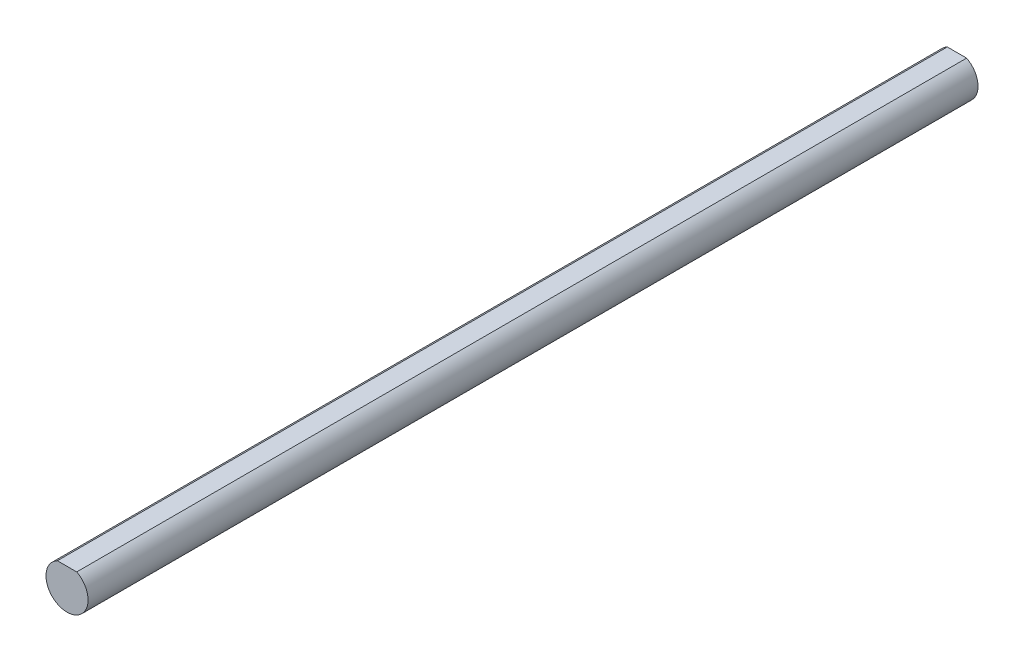
ISO-10303-21;
HEADER;
FILE_DESCRIPTION(('STEP AP214'),'2;1');
FILE_NAME('part.step','',(''),(''),'','','');
FILE_SCHEMA(('AUTOMOTIVE_DESIGN { 1 0 10303 214 1 1 1 1 }'));
ENDSEC;
DATA;
#1=APPLICATION_CONTEXT('core data for automotive mechanical design processes');
#2=APPLICATION_PROTOCOL_DEFINITION('international standard','automotive_design',2000,#1);
#3=PRODUCT_CONTEXT('',#1,'mechanical');
#4=PRODUCT('Part','Part','',(#3));
#5=PRODUCT_RELATED_PRODUCT_CATEGORY('part','',(#4));
#6=PRODUCT_DEFINITION_FORMATION('','',#4);
#7=PRODUCT_DEFINITION_CONTEXT('part definition',#1,'design');
#8=PRODUCT_DEFINITION('design','',#6,#7);
#9=PRODUCT_DEFINITION_SHAPE('','',#8);
#10=(LENGTH_UNIT() NAMED_UNIT(*) SI_UNIT(.MILLI.,.METRE.));
#11=(NAMED_UNIT(*) PLANE_ANGLE_UNIT() SI_UNIT($,.RADIAN.));
#12=(NAMED_UNIT(*) SI_UNIT($,.STERADIAN.) SOLID_ANGLE_UNIT());
#13=UNCERTAINTY_MEASURE_WITH_UNIT(LENGTH_MEASURE(1.E-05),#10,'distance_accuracy_value','');
#14=(GEOMETRIC_REPRESENTATION_CONTEXT(3) GLOBAL_UNCERTAINTY_ASSIGNED_CONTEXT((#13)) GLOBAL_UNIT_ASSIGNED_CONTEXT((#10,
#11,#12)) REPRESENTATION_CONTEXT('',''));
#15=CARTESIAN_POINT('',(0.,0.,0.));
#16=DIRECTION('',(0.,0.,1.));
#17=DIRECTION('',(1.,0.,0.));
#18=AXIS2_PLACEMENT_3D('',#15,#16,#17);
#19=CARTESIAN_POINT('',(0.,0.,-50.));
#20=DIRECTION('',(0.,0.,1.));
#21=DIRECTION('',(1.,0.,0.));
#22=AXIS2_PLACEMENT_3D('',#19,#20,#21);
#23=CYLINDRICAL_SURFACE('',#22,2.365);
#24=CARTESIAN_POINT('',(0.,0.,50.));
#25=DIRECTION('',(0.,0.,1.));
#26=DIRECTION('',(1.,0.,0.));
#27=AXIS2_PLACEMENT_3D('',#24,#25,#26);
#28=CIRCLE('',#27,2.365);
#29=CARTESIAN_POINT('',(-1.0877614628217,2.1,50.));
#30=VERTEX_POINT('',#29);
#31=CARTESIAN_POINT('',(1.0877614628217,2.1,50.));
#32=VERTEX_POINT('',#31);
#33=EDGE_CURVE('E61',#30,#32,#28,.T.);
#34=ORIENTED_EDGE('',*,*,#33,.F.);
#35=DIRECTION('',(0.,0.,1.));
#36=VECTOR('',#35,1.);
#37=CARTESIAN_POINT('',(-1.0877614628217,2.1,-50.));
#38=LINE('',#37,#36);
#39=CARTESIAN_POINT('',(-1.0877614628217,2.1,-50.));
#40=VERTEX_POINT('',#39);
#41=EDGE_CURVE('E11',#40,#30,#38,.T.);
#42=ORIENTED_EDGE('',*,*,#41,.F.);
#43=CARTESIAN_POINT('',(0.,0.,-50.));
#44=DIRECTION('',(0.,0.,1.));
#45=DIRECTION('',(1.,0.,0.));
#46=AXIS2_PLACEMENT_3D('',#43,#44,#45);
#47=CIRCLE('',#46,2.365);
#48=CARTESIAN_POINT('',(1.0877614628217,2.1,-50.));
#49=VERTEX_POINT('',#48);
#50=EDGE_CURVE('E65',#40,#49,#47,.T.);
#51=ORIENTED_EDGE('',*,*,#50,.T.);
#52=DIRECTION('',(0.,0.,1.));
#53=VECTOR('',#52,1.);
#54=CARTESIAN_POINT('',(1.0877614628217,2.1,-50.));
#55=LINE('',#54,#53);
#56=EDGE_CURVE('E35',#49,#32,#55,.T.);
#57=ORIENTED_EDGE('',*,*,#56,.T.);
#58=EDGE_LOOP('',(#34,#42,#51,#57));
#59=FACE_BOUND('',#58,.T.);
#60=ADVANCED_FACE('F32',(#59),#23,.T.);
#61=CARTESIAN_POINT('',(-1.0877614628217,2.1,-50.));
#62=DIRECTION('',(0.,1.,0.));
#63=DIRECTION('',(0.,0.,1.));
#64=AXIS2_PLACEMENT_3D('',#61,#62,#63);
#65=PLANE('',#64);
#66=DIRECTION('',(-1.,0.,0.));
#67=VECTOR('',#66,1.);
#68=CARTESIAN_POINT('',(-1.0877614628217,2.1,50.));
#69=LINE('',#68,#67);
#70=EDGE_CURVE('E58',#32,#30,#69,.T.);
#71=ORIENTED_EDGE('',*,*,#70,.F.);
#72=ORIENTED_EDGE('',*,*,#56,.F.);
#73=DIRECTION('',(-1.,0.,0.));
#74=VECTOR('',#73,1.);
#75=CARTESIAN_POINT('',(-1.0877614628217,2.1,-50.));
#76=LINE('',#75,#74);
#77=EDGE_CURVE('E60',#49,#40,#76,.T.);
#78=ORIENTED_EDGE('',*,*,#77,.T.);
#79=ORIENTED_EDGE('',*,*,#41,.T.);
#80=EDGE_LOOP('',(#71,#72,#78,#79));
#81=FACE_BOUND('',#80,.T.);
#82=ADVANCED_FACE('F56',(#81),#65,.T.);
#83=CARTESIAN_POINT('',(0.,0.,-50.));
#84=DIRECTION('',(0.,0.,1.));
#85=DIRECTION('',(1.,0.,0.));
#86=AXIS2_PLACEMENT_3D('',#83,#84,#85);
#87=PLANE('',#86);
#88=ORIENTED_EDGE('',*,*,#50,.F.);
#89=ORIENTED_EDGE('',*,*,#77,.F.);
#90=EDGE_LOOP('',(#88,#89));
#91=FACE_BOUND('',#90,.T.);
#92=ADVANCED_FACE('F70',(#91),#87,.F.);
#93=CARTESIAN_POINT('',(0.,0.,50.));
#94=DIRECTION('',(0.,0.,1.));
#95=DIRECTION('',(1.,0.,0.));
#96=AXIS2_PLACEMENT_3D('',#93,#94,#95);
#97=PLANE('',#96);
#98=ORIENTED_EDGE('',*,*,#33,.T.);
#99=ORIENTED_EDGE('',*,*,#70,.T.);
#100=EDGE_LOOP('',(#98,#99));
#101=FACE_BOUND('',#100,.T.);
#102=ADVANCED_FACE('F64',(#101),#97,.T.);
#103=CLOSED_SHELL('',(#60,#82,#92,#102));
#104=MANIFOLD_SOLID_BREP('B2',#103);
#105=ADVANCED_BREP_SHAPE_REPRESENTATION('',(#18,#104),#14);
#106=SHAPE_DEFINITION_REPRESENTATION(#9,#105);
ENDSEC;
END-ISO-10303-21;
